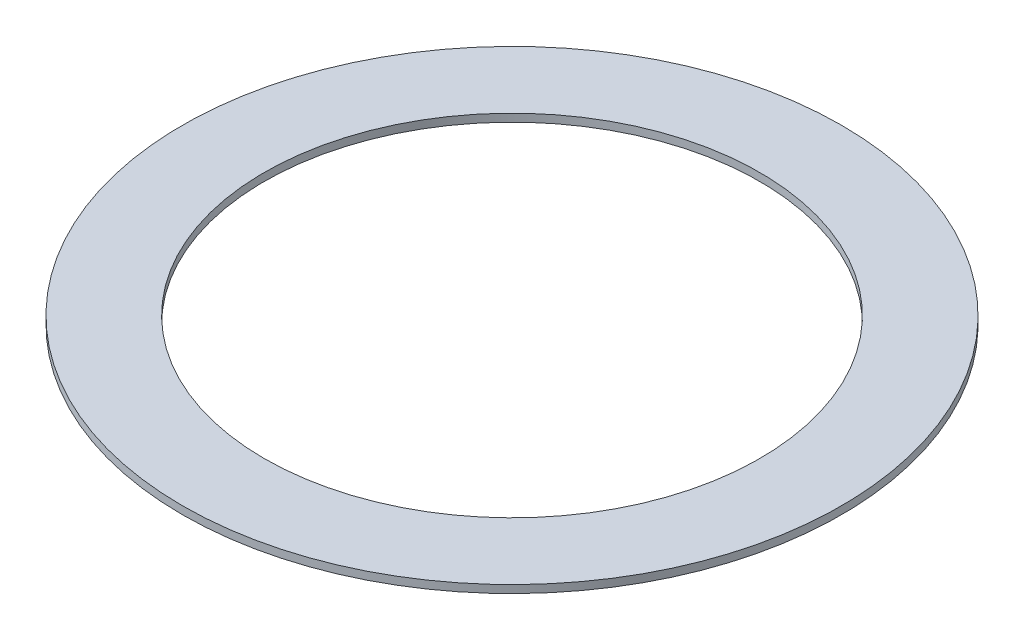
ISO-10303-21;
HEADER;
FILE_DESCRIPTION(('STEP AP214'),'2;1');
FILE_NAME('part.step','',(''),(''),'','','');
FILE_SCHEMA(('AUTOMOTIVE_DESIGN { 1 0 10303 214 1 1 1 1 }'));
ENDSEC;
DATA;
#1=APPLICATION_CONTEXT('core data for automotive mechanical design processes');
#2=APPLICATION_PROTOCOL_DEFINITION('international standard','automotive_design',2000,#1);
#3=PRODUCT_CONTEXT('',#1,'mechanical');
#4=PRODUCT('Part','Part','',(#3));
#5=PRODUCT_RELATED_PRODUCT_CATEGORY('part','',(#4));
#6=PRODUCT_DEFINITION_FORMATION('','',#4);
#7=PRODUCT_DEFINITION_CONTEXT('part definition',#1,'design');
#8=PRODUCT_DEFINITION('design','',#6,#7);
#9=PRODUCT_DEFINITION_SHAPE('','',#8);
#10=(LENGTH_UNIT() NAMED_UNIT(*) SI_UNIT(.MILLI.,.METRE.));
#11=(NAMED_UNIT(*) PLANE_ANGLE_UNIT() SI_UNIT($,.RADIAN.));
#12=(NAMED_UNIT(*) SI_UNIT($,.STERADIAN.) SOLID_ANGLE_UNIT());
#13=UNCERTAINTY_MEASURE_WITH_UNIT(LENGTH_MEASURE(1.E-05),#10,'distance_accuracy_value','');
#14=(GEOMETRIC_REPRESENTATION_CONTEXT(3) GLOBAL_UNCERTAINTY_ASSIGNED_CONTEXT((#13)) GLOBAL_UNIT_ASSIGNED_CONTEXT((#10,
#11,#12)) REPRESENTATION_CONTEXT('',''));
#15=CARTESIAN_POINT('',(0.,0.,0.));
#16=DIRECTION('',(0.,0.,1.));
#17=DIRECTION('',(1.,0.,0.));
#18=AXIS2_PLACEMENT_3D('',#15,#16,#17);
#19=CARTESIAN_POINT('',(0.,2.4,0.));
#20=DIRECTION('',(0.,1.,0.));
#21=DIRECTION('',(0.,0.,1.));
#22=AXIS2_PLACEMENT_3D('',#19,#20,#21);
#23=PLANE('',#22);
#24=CARTESIAN_POINT('',(0.,2.4,0.));
#25=DIRECTION('',(0.,1.,0.));
#26=DIRECTION('',(0.,0.,1.));
#27=AXIS2_PLACEMENT_3D('',#24,#25,#26);
#28=CIRCLE('',#27,101.346);
#29=CARTESIAN_POINT('',(0.,2.4,101.346));
#30=VERTEX_POINT('',#29);
#31=EDGE_CURVE('E10',#30,#30,#28,.T.);
#32=ORIENTED_EDGE('',*,*,#31,.T.);
#33=EDGE_LOOP('',(#32));
#34=FACE_BOUND('',#33,.T.);
#35=CARTESIAN_POINT('',(0.,2.4,0.));
#36=DIRECTION('',(0.,1.,0.));
#37=DIRECTION('',(0.,0.,1.));
#38=AXIS2_PLACEMENT_3D('',#35,#36,#37);
#39=CIRCLE('',#38,76.2);
#40=CARTESIAN_POINT('',(0.,2.4,76.2));
#41=VERTEX_POINT('',#40);
#42=EDGE_CURVE('E43',#41,#41,#39,.T.);
#43=ORIENTED_EDGE('',*,*,#42,.F.);
#44=EDGE_LOOP('',(#43));
#45=FACE_BOUND('',#44,.T.);
#46=ADVANCED_FACE('F32',(#34,#45),#23,.T.);
#47=CARTESIAN_POINT('',(0.,0.,0.));
#48=DIRECTION('',(0.,1.,0.));
#49=DIRECTION('',(0.,0.,1.));
#50=AXIS2_PLACEMENT_3D('',#47,#48,#49);
#51=PLANE('',#50);
#52=CARTESIAN_POINT('',(0.,0.,0.));
#53=DIRECTION('',(0.,1.,0.));
#54=DIRECTION('',(0.,0.,1.));
#55=AXIS2_PLACEMENT_3D('',#52,#53,#54);
#56=CIRCLE('',#55,101.346);
#57=CARTESIAN_POINT('',(0.,0.,101.346));
#58=VERTEX_POINT('',#57);
#59=EDGE_CURVE('E36',#58,#58,#56,.T.);
#60=ORIENTED_EDGE('',*,*,#59,.F.);
#61=EDGE_LOOP('',(#60));
#62=FACE_BOUND('',#61,.T.);
#63=CARTESIAN_POINT('',(0.,0.,0.));
#64=DIRECTION('',(0.,1.,0.));
#65=DIRECTION('',(0.,0.,1.));
#66=AXIS2_PLACEMENT_3D('',#63,#64,#65);
#67=CIRCLE('',#66,76.2);
#68=CARTESIAN_POINT('',(0.,0.,76.2));
#69=VERTEX_POINT('',#68);
#70=EDGE_CURVE('E45',#69,#69,#67,.T.);
#71=ORIENTED_EDGE('',*,*,#70,.T.);
#72=EDGE_LOOP('',(#71));
#73=FACE_BOUND('',#72,.T.);
#74=ADVANCED_FACE('F55',(#62,#73),#51,.F.);
#75=CARTESIAN_POINT('',(0.,2.4,0.));
#76=DIRECTION('',(0.,-1.,0.));
#77=DIRECTION('',(0.,0.,-1.));
#78=AXIS2_PLACEMENT_3D('',#75,#76,#77);
#79=CYLINDRICAL_SURFACE('',#78,101.346);
#80=ORIENTED_EDGE('',*,*,#31,.F.);
#81=EDGE_LOOP('',(#80));
#82=FACE_BOUND('',#81,.T.);
#83=ORIENTED_EDGE('',*,*,#59,.T.);
#84=EDGE_LOOP('',(#83));
#85=FACE_BOUND('',#84,.T.);
#86=ADVANCED_FACE('F34',(#82,#85),#79,.T.);
#87=CARTESIAN_POINT('',(0.,2.4,0.));
#88=DIRECTION('',(0.,-1.,0.));
#89=DIRECTION('',(0.,0.,-1.));
#90=AXIS2_PLACEMENT_3D('',#87,#88,#89);
#91=CYLINDRICAL_SURFACE('',#90,76.2);
#92=ORIENTED_EDGE('',*,*,#42,.T.);
#93=EDGE_LOOP('',(#92));
#94=FACE_BOUND('',#93,.T.);
#95=ORIENTED_EDGE('',*,*,#70,.F.);
#96=EDGE_LOOP('',(#95));
#97=FACE_BOUND('',#96,.T.);
#98=ADVANCED_FACE('F51',(#94,#97),#91,.F.);
#99=CLOSED_SHELL('',(#46,#74,#86,#98));
#100=MANIFOLD_SOLID_BREP('B2',#99);
#101=ADVANCED_BREP_SHAPE_REPRESENTATION('',(#18,#100),#14);
#102=SHAPE_DEFINITION_REPRESENTATION(#9,#101);
ENDSEC;
END-ISO-10303-21;
